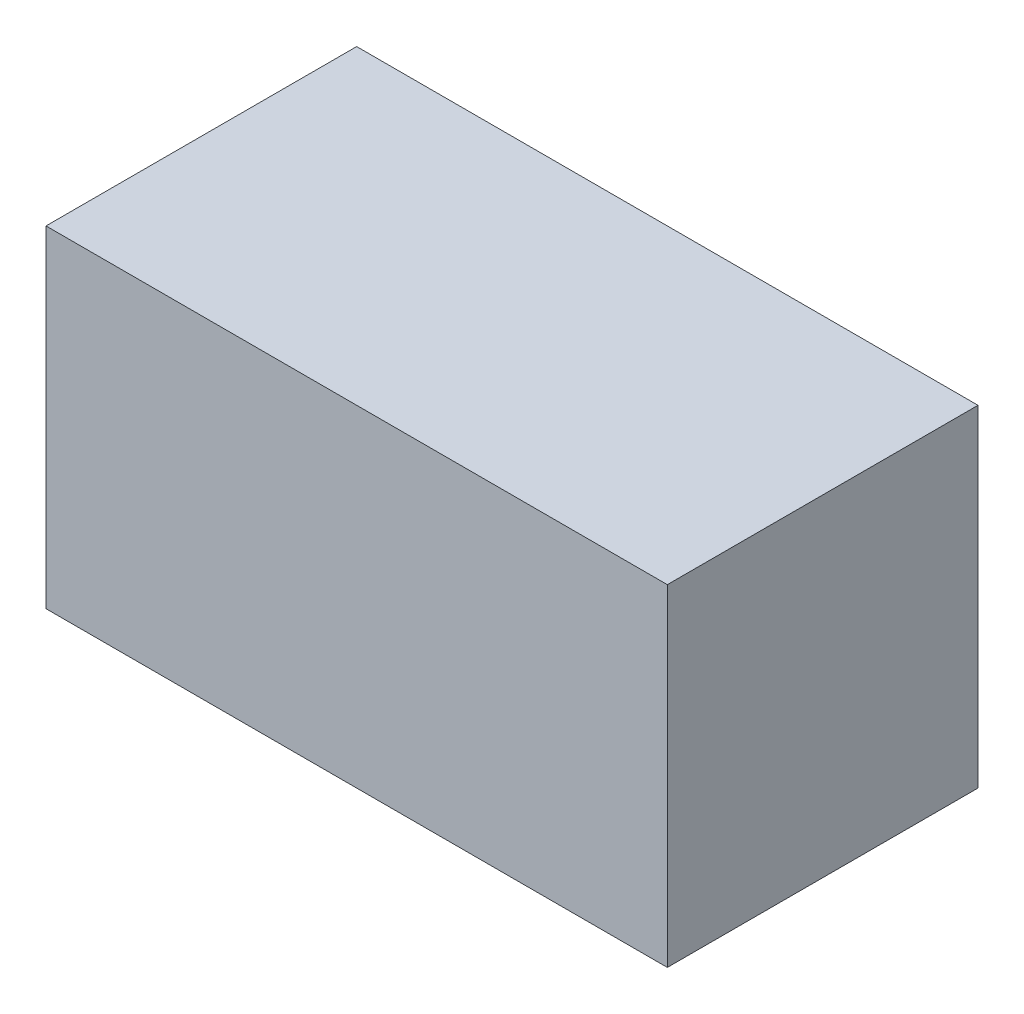
ISO-10303-21;
HEADER;
FILE_DESCRIPTION(('STEP AP214'),'2;1');
FILE_NAME('part.step','',(''),(''),'','','');
FILE_SCHEMA(('AUTOMOTIVE_DESIGN { 1 0 10303 214 1 1 1 1 }'));
ENDSEC;
DATA;
#1=APPLICATION_CONTEXT('core data for automotive mechanical design processes');
#2=APPLICATION_PROTOCOL_DEFINITION('international standard','automotive_design',2000,#1);
#3=PRODUCT_CONTEXT('',#1,'mechanical');
#4=PRODUCT('Part','Part','',(#3));
#5=PRODUCT_RELATED_PRODUCT_CATEGORY('part','',(#4));
#6=PRODUCT_DEFINITION_FORMATION('','',#4);
#7=PRODUCT_DEFINITION_CONTEXT('part definition',#1,'design');
#8=PRODUCT_DEFINITION('design','',#6,#7);
#9=PRODUCT_DEFINITION_SHAPE('','',#8);
#10=(LENGTH_UNIT() NAMED_UNIT(*) SI_UNIT(.MILLI.,.METRE.));
#11=(NAMED_UNIT(*) PLANE_ANGLE_UNIT() SI_UNIT($,.RADIAN.));
#12=(NAMED_UNIT(*) SI_UNIT($,.STERADIAN.) SOLID_ANGLE_UNIT());
#13=UNCERTAINTY_MEASURE_WITH_UNIT(LENGTH_MEASURE(1.E-05),#10,'distance_accuracy_value','');
#14=(GEOMETRIC_REPRESENTATION_CONTEXT(3) GLOBAL_UNCERTAINTY_ASSIGNED_CONTEXT((#13)) GLOBAL_UNIT_ASSIGNED_CONTEXT((#10,
#11,#12)) REPRESENTATION_CONTEXT('',''));
#15=CARTESIAN_POINT('',(0.,0.,0.));
#16=DIRECTION('',(0.,0.,1.));
#17=DIRECTION('',(1.,0.,0.));
#18=AXIS2_PLACEMENT_3D('',#15,#16,#17);
#19=CARTESIAN_POINT('',(-121.650612222677,-138.770848591098,4.));
#20=DIRECTION('',(0.,0.,1.));
#21=DIRECTION('',(0.,-1.,0.));
#22=AXIS2_PLACEMENT_3D('',#19,#20,#21);
#23=PLANE('',#22);
#24=DIRECTION('',(0.,-1.,0.));
#25=VECTOR('',#24,1.);
#26=CARTESIAN_POINT('',(-133.35,-138.770848591098,4.));
#27=LINE('',#26,#25);
#28=CARTESIAN_POINT('',(-133.35,-138.770848591098,4.));
#29=VERTEX_POINT('',#28);
#30=CARTESIAN_POINT('',(-133.35,-147.307573628499,4.));
#31=VERTEX_POINT('',#30);
#32=EDGE_CURVE('E42',#29,#31,#27,.T.);
#33=ORIENTED_EDGE('',*,*,#32,.F.);
#34=DIRECTION('',(-1.,0.,0.));
#35=VECTOR('',#34,1.);
#36=CARTESIAN_POINT('',(-121.650612222677,-138.770848591098,4.));
#37=LINE('',#36,#35);
#38=CARTESIAN_POINT('',(-149.35,-138.770848591098,4.));
#39=VERTEX_POINT('',#38);
#40=EDGE_CURVE('E70',#29,#39,#37,.T.);
#41=ORIENTED_EDGE('',*,*,#40,.T.);
#42=DIRECTION('',(0.,1.,0.));
#43=VECTOR('',#42,1.);
#44=CARTESIAN_POINT('',(-149.35,-138.770848591098,4.));
#45=LINE('',#44,#43);
#46=CARTESIAN_POINT('',(-149.35,-147.307573628499,4.));
#47=VERTEX_POINT('',#46);
#48=EDGE_CURVE('E74',#47,#39,#45,.T.);
#49=ORIENTED_EDGE('',*,*,#48,.F.);
#50=DIRECTION('',(-1.,0.,0.));
#51=VECTOR('',#50,1.);
#52=CARTESIAN_POINT('',(-121.650612222677,-147.307573628499,4.));
#53=LINE('',#52,#51);
#54=EDGE_CURVE('E97',#31,#47,#53,.T.);
#55=ORIENTED_EDGE('',*,*,#54,.F.);
#56=EDGE_LOOP('',(#33,#41,#49,#55));
#57=FACE_BOUND('',#56,.T.);
#58=ADVANCED_FACE('F34',(#57),#23,.T.);
#59=CARTESIAN_POINT('',(-121.650612222677,-147.307573628499,4.));
#60=DIRECTION('',(0.,-1.,0.));
#61=DIRECTION('',(0.,0.,-1.));
#62=AXIS2_PLACEMENT_3D('',#59,#60,#61);
#63=PLANE('',#62);
#64=DIRECTION('',(0.,0.,-1.));
#65=VECTOR('',#64,1.);
#66=CARTESIAN_POINT('',(-133.35,-147.307573628499,4.));
#67=LINE('',#66,#65);
#68=CARTESIAN_POINT('',(-133.35,-147.307573628499,-4.));
#69=VERTEX_POINT('',#68);
#70=EDGE_CURVE('E48',#31,#69,#67,.T.);
#71=ORIENTED_EDGE('',*,*,#70,.F.);
#72=ORIENTED_EDGE('',*,*,#54,.T.);
#73=DIRECTION('',(0.,0.,1.));
#74=VECTOR('',#73,1.);
#75=CARTESIAN_POINT('',(-149.35,-147.307573628499,4.));
#76=LINE('',#75,#74);
#77=CARTESIAN_POINT('',(-149.35,-147.307573628499,-4.));
#78=VERTEX_POINT('',#77);
#79=EDGE_CURVE('E79',#78,#47,#76,.T.);
#80=ORIENTED_EDGE('',*,*,#79,.F.);
#81=DIRECTION('',(-1.,0.,0.));
#82=VECTOR('',#81,1.);
#83=CARTESIAN_POINT('',(-121.650612222677,-147.307573628499,-4.));
#84=LINE('',#83,#82);
#85=EDGE_CURVE('E100',#69,#78,#84,.T.);
#86=ORIENTED_EDGE('',*,*,#85,.F.);
#87=EDGE_LOOP('',(#71,#72,#80,#86));
#88=FACE_BOUND('',#87,.T.);
#89=ADVANCED_FACE('F106',(#88),#63,.T.);
#90=CARTESIAN_POINT('',(-121.650612222677,-138.770848591098,-4.));
#91=DIRECTION('',(0.,0.,-1.));
#92=DIRECTION('',(0.,1.,0.));
#93=AXIS2_PLACEMENT_3D('',#90,#91,#92);
#94=PLANE('',#93);
#95=DIRECTION('',(0.,1.,0.));
#96=VECTOR('',#95,1.);
#97=CARTESIAN_POINT('',(-133.35,-138.770848591098,-4.));
#98=LINE('',#97,#96);
#99=CARTESIAN_POINT('',(-133.35,-138.770848591098,-4.));
#100=VERTEX_POINT('',#99);
#101=EDGE_CURVE('E99',#69,#100,#98,.T.);
#102=ORIENTED_EDGE('',*,*,#101,.F.);
#103=ORIENTED_EDGE('',*,*,#85,.T.);
#104=DIRECTION('',(0.,-1.,0.));
#105=VECTOR('',#104,1.);
#106=CARTESIAN_POINT('',(-149.35,-138.770848591098,-4.));
#107=LINE('',#106,#105);
#108=CARTESIAN_POINT('',(-149.35,-138.770848591098,-4.));
#109=VERTEX_POINT('',#108);
#110=EDGE_CURVE('E87',#109,#78,#107,.T.);
#111=ORIENTED_EDGE('',*,*,#110,.F.);
#112=DIRECTION('',(-1.,0.,0.));
#113=VECTOR('',#112,1.);
#114=CARTESIAN_POINT('',(-121.650612222677,-138.770848591098,-4.));
#115=LINE('',#114,#113);
#116=EDGE_CURVE('E78',#100,#109,#115,.T.);
#117=ORIENTED_EDGE('',*,*,#116,.F.);
#118=EDGE_LOOP('',(#102,#103,#111,#117));
#119=FACE_BOUND('',#118,.T.);
#120=ADVANCED_FACE('F104',(#119),#94,.T.);
#121=CARTESIAN_POINT('',(-121.650612222677,-138.770848591098,4.));
#122=DIRECTION('',(0.,1.,0.));
#123=DIRECTION('',(0.,0.,1.));
#124=AXIS2_PLACEMENT_3D('',#121,#122,#123);
#125=PLANE('',#124);
#126=DIRECTION('',(0.,0.,1.));
#127=VECTOR('',#126,1.);
#128=CARTESIAN_POINT('',(-133.35,-138.770848591098,4.));
#129=LINE('',#128,#127);
#130=EDGE_CURVE('E11',#100,#29,#129,.T.);
#131=ORIENTED_EDGE('',*,*,#130,.F.);
#132=ORIENTED_EDGE('',*,*,#116,.T.);
#133=DIRECTION('',(0.,0.,-1.));
#134=VECTOR('',#133,1.);
#135=CARTESIAN_POINT('',(-149.35,-138.770848591098,4.));
#136=LINE('',#135,#134);
#137=EDGE_CURVE('E81',#39,#109,#136,.T.);
#138=ORIENTED_EDGE('',*,*,#137,.F.);
#139=ORIENTED_EDGE('',*,*,#40,.F.);
#140=EDGE_LOOP('',(#131,#132,#138,#139));
#141=FACE_BOUND('',#140,.T.);
#142=ADVANCED_FACE('F82',(#141),#125,.T.);
#143=CARTESIAN_POINT('',(-149.35,0.,0.));
#144=DIRECTION('',(1.,0.,0.));
#145=DIRECTION('',(0.,0.,-1.));
#146=AXIS2_PLACEMENT_3D('',#143,#144,#145);
#147=PLANE('',#146);
#148=ORIENTED_EDGE('',*,*,#48,.T.);
#149=ORIENTED_EDGE('',*,*,#137,.T.);
#150=ORIENTED_EDGE('',*,*,#110,.T.);
#151=ORIENTED_EDGE('',*,*,#79,.T.);
#152=EDGE_LOOP('',(#148,#149,#150,#151));
#153=FACE_BOUND('',#152,.T.);
#154=ADVANCED_FACE('F89',(#153),#147,.F.);
#155=CARTESIAN_POINT('',(-133.35,-155.807573628499,0.));
#156=DIRECTION('',(-1.,0.,0.));
#157=DIRECTION('',(0.,0.,1.));
#158=AXIS2_PLACEMENT_3D('',#155,#156,#157);
#159=PLANE('',#158);
#160=ORIENTED_EDGE('',*,*,#32,.T.);
#161=ORIENTED_EDGE('',*,*,#70,.T.);
#162=ORIENTED_EDGE('',*,*,#101,.T.);
#163=ORIENTED_EDGE('',*,*,#130,.T.);
#164=EDGE_LOOP('',(#160,#161,#162,#163));
#165=FACE_BOUND('',#164,.T.);
#166=ADVANCED_FACE('F108',(#165),#159,.F.);
#167=CLOSED_SHELL('',(#58,#89,#120,#142,#154,#166));
#168=MANIFOLD_SOLID_BREP('B2',#167);
#169=ADVANCED_BREP_SHAPE_REPRESENTATION('',(#18,#168),#14);
#170=SHAPE_DEFINITION_REPRESENTATION(#9,#169);
ENDSEC;
END-ISO-10303-21;
